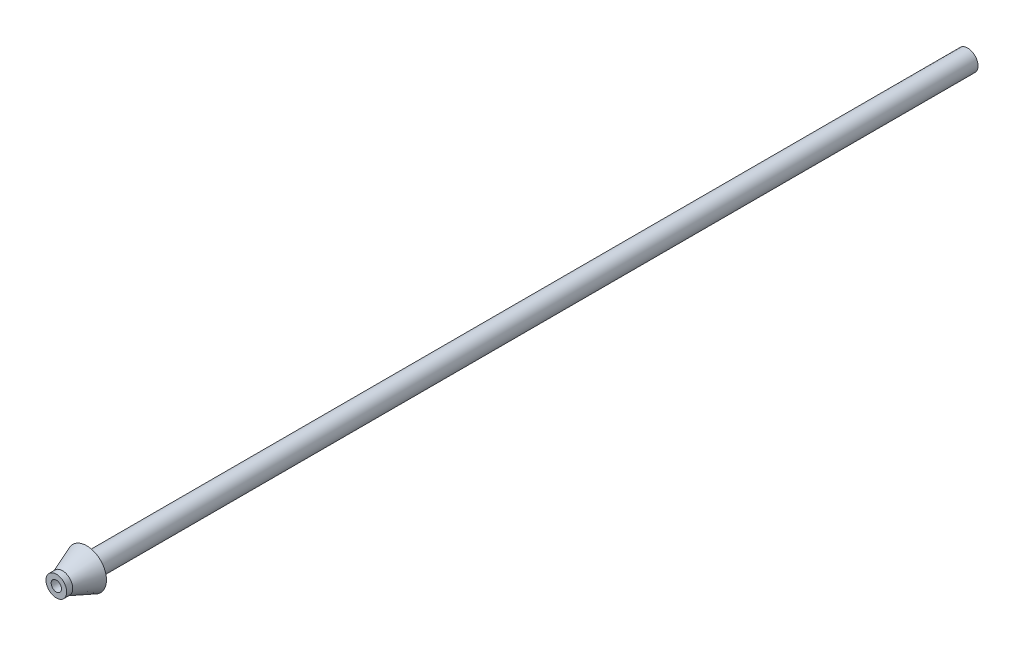
ISO-10303-21;
HEADER;
FILE_DESCRIPTION(('STEP AP214'),'2;1');
FILE_NAME('part.step','',(''),(''),'','','');
FILE_SCHEMA(('AUTOMOTIVE_DESIGN { 1 0 10303 214 1 1 1 1 }'));
ENDSEC;
DATA;
#1=APPLICATION_CONTEXT('core data for automotive mechanical design processes');
#2=APPLICATION_PROTOCOL_DEFINITION('international standard','automotive_design',2000,#1);
#3=PRODUCT_CONTEXT('',#1,'mechanical');
#4=PRODUCT('Part','Part','',(#3));
#5=PRODUCT_RELATED_PRODUCT_CATEGORY('part','',(#4));
#6=PRODUCT_DEFINITION_FORMATION('','',#4);
#7=PRODUCT_DEFINITION_CONTEXT('part definition',#1,'design');
#8=PRODUCT_DEFINITION('design','',#6,#7);
#9=PRODUCT_DEFINITION_SHAPE('','',#8);
#10=(LENGTH_UNIT() NAMED_UNIT(*) SI_UNIT(.MILLI.,.METRE.));
#11=(NAMED_UNIT(*) PLANE_ANGLE_UNIT() SI_UNIT($,.RADIAN.));
#12=(NAMED_UNIT(*) SI_UNIT($,.STERADIAN.) SOLID_ANGLE_UNIT());
#13=UNCERTAINTY_MEASURE_WITH_UNIT(LENGTH_MEASURE(1.E-05),#10,'distance_accuracy_value','');
#14=(GEOMETRIC_REPRESENTATION_CONTEXT(3) GLOBAL_UNCERTAINTY_ASSIGNED_CONTEXT((#13)) GLOBAL_UNIT_ASSIGNED_CONTEXT((#10,
#11,#12)) REPRESENTATION_CONTEXT('',''));
#15=CARTESIAN_POINT('',(0.,0.,0.));
#16=DIRECTION('',(0.,0.,1.));
#17=DIRECTION('',(1.,0.,0.));
#18=AXIS2_PLACEMENT_3D('',#15,#16,#17);
#19=CARTESIAN_POINT('',(0.,0.,150.));
#20=DIRECTION('',(0.,0.,-1.));
#21=DIRECTION('',(-1.,0.,0.));
#22=AXIS2_PLACEMENT_3D('',#19,#20,#21);
#23=CYLINDRICAL_SURFACE('',#22,1.7);
#24=CARTESIAN_POINT('',(0.,0.,150.));
#25=DIRECTION('',(0.,0.,1.));
#26=DIRECTION('',(1.,0.,0.));
#27=AXIS2_PLACEMENT_3D('',#24,#25,#26);
#28=CIRCLE('',#27,1.7);
#29=CARTESIAN_POINT('',(1.7,0.,150.));
#30=VERTEX_POINT('',#29);
#31=EDGE_CURVE('E45',#30,#30,#28,.T.);
#32=ORIENTED_EDGE('',*,*,#31,.F.);
#33=EDGE_LOOP('',(#32));
#34=FACE_BOUND('',#33,.T.);
#35=CARTESIAN_POINT('',(0.,0.,149.));
#36=DIRECTION('',(0.,0.,-1.));
#37=DIRECTION('',(-1.,0.,0.));
#38=AXIS2_PLACEMENT_3D('',#35,#36,#37);
#39=CIRCLE('',#38,1.7);
#40=CARTESIAN_POINT('',(-1.7,0.,149.));
#41=VERTEX_POINT('',#40);
#42=EDGE_CURVE('E10',#41,#41,#39,.T.);
#43=ORIENTED_EDGE('',*,*,#42,.F.);
#44=EDGE_LOOP('',(#43));
#45=FACE_BOUND('',#44,.T.);
#46=ADVANCED_FACE('F35',(#34,#45),#23,.T.);
#47=CARTESIAN_POINT('',(0.,0.,0.));
#48=DIRECTION('',(0.,0.,1.));
#49=DIRECTION('',(1.,0.,0.));
#50=AXIS2_PLACEMENT_3D('',#47,#48,#49);
#51=CIRCLE('',#50,1.7);
#52=CARTESIAN_POINT('',(1.7,0.,0.));
#53=VERTEX_POINT('',#52);
#54=EDGE_CURVE('E49',#53,#53,#51,.T.);
#55=ORIENTED_EDGE('',*,*,#54,.T.);
#56=EDGE_LOOP('',(#55));
#57=FACE_BOUND('',#56,.T.);
#58=CARTESIAN_POINT('',(0.,0.,145.));
#59=DIRECTION('',(0.,0.,1.));
#60=DIRECTION('',(1.,0.,0.));
#61=AXIS2_PLACEMENT_3D('',#58,#59,#60);
#62=CIRCLE('',#61,1.7);
#63=CARTESIAN_POINT('',(1.7,0.,145.));
#64=VERTEX_POINT('',#63);
#65=EDGE_CURVE('E41',#64,#64,#62,.T.);
#66=ORIENTED_EDGE('',*,*,#65,.F.);
#67=EDGE_LOOP('',(#66));
#68=FACE_BOUND('',#67,.T.);
#69=ADVANCED_FACE('F75',(#57,#68),#23,.T.);
#70=CARTESIAN_POINT('',(0.,0.,150.));
#71=DIRECTION('',(0.,0.,1.));
#72=DIRECTION('',(1.,0.,0.));
#73=AXIS2_PLACEMENT_3D('',#70,#71,#72);
#74=PLANE('',#73);
#75=ORIENTED_EDGE('',*,*,#31,.T.);
#76=EDGE_LOOP('',(#75));
#77=FACE_BOUND('',#76,.T.);
#78=CARTESIAN_POINT('',(0.,0.,150.));
#79=DIRECTION('',(0.,0.,1.));
#80=DIRECTION('',(1.,0.,0.));
#81=AXIS2_PLACEMENT_3D('',#78,#79,#80);
#82=CIRCLE('',#81,0.85);
#83=CARTESIAN_POINT('',(0.85,0.,150.));
#84=VERTEX_POINT('',#83);
#85=EDGE_CURVE('E53',#84,#84,#82,.T.);
#86=ORIENTED_EDGE('',*,*,#85,.F.);
#87=EDGE_LOOP('',(#86));
#88=FACE_BOUND('',#87,.T.);
#89=ADVANCED_FACE('F80',(#77,#88),#74,.T.);
#90=CARTESIAN_POINT('',(0.,0.,0.));
#91=DIRECTION('',(0.,0.,1.));
#92=DIRECTION('',(1.,0.,0.));
#93=AXIS2_PLACEMENT_3D('',#90,#91,#92);
#94=PLANE('',#93);
#95=ORIENTED_EDGE('',*,*,#54,.F.);
#96=EDGE_LOOP('',(#95));
#97=FACE_BOUND('',#96,.T.);
#98=CARTESIAN_POINT('',(0.,0.,0.));
#99=DIRECTION('',(0.,0.,1.));
#100=DIRECTION('',(1.,0.,0.));
#101=AXIS2_PLACEMENT_3D('',#98,#99,#100);
#102=CIRCLE('',#101,0.85);
#103=CARTESIAN_POINT('',(0.85,0.,0.));
#104=VERTEX_POINT('',#103);
#105=EDGE_CURVE('E55',#104,#104,#102,.T.);
#106=ORIENTED_EDGE('',*,*,#105,.T.);
#107=EDGE_LOOP('',(#106));
#108=FACE_BOUND('',#107,.T.);
#109=ADVANCED_FACE('F87',(#97,#108),#94,.F.);
#110=CARTESIAN_POINT('',(0.,0.,150.));
#111=DIRECTION('',(0.,0.,-1.));
#112=DIRECTION('',(-1.,0.,0.));
#113=AXIS2_PLACEMENT_3D('',#110,#111,#112);
#114=CYLINDRICAL_SURFACE('',#113,0.85);
#115=ORIENTED_EDGE('',*,*,#85,.T.);
#116=EDGE_LOOP('',(#115));
#117=FACE_BOUND('',#116,.T.);
#118=ORIENTED_EDGE('',*,*,#105,.F.);
#119=EDGE_LOOP('',(#118));
#120=FACE_BOUND('',#119,.T.);
#121=ADVANCED_FACE('F72',(#117,#120),#114,.F.);
#122=CARTESIAN_POINT('',(0.,0.,145.));
#123=DIRECTION('',(0.,0.,-1.));
#124=DIRECTION('',(-1.,0.,0.));
#125=AXIS2_PLACEMENT_3D('',#122,#123,#124);
#126=CONICAL_SURFACE('',#125,3.25,0.369684288795301);
#127=ORIENTED_EDGE('',*,*,#42,.T.);
#128=EDGE_LOOP('',(#127));
#129=FACE_BOUND('',#128,.T.);
#130=CARTESIAN_POINT('',(0.,0.,145.));
#131=DIRECTION('',(0.,0.,1.));
#132=DIRECTION('',(1.,0.,0.));
#133=AXIS2_PLACEMENT_3D('',#130,#131,#132);
#134=CIRCLE('',#133,3.25);
#135=CARTESIAN_POINT('',(3.25,0.,145.));
#136=VERTEX_POINT('',#135);
#137=EDGE_CURVE('E58',#136,#136,#134,.T.);
#138=ORIENTED_EDGE('',*,*,#137,.T.);
#139=EDGE_LOOP('',(#138));
#140=FACE_BOUND('',#139,.T.);
#141=ADVANCED_FACE('F64',(#129,#140),#126,.T.);
#142=CARTESIAN_POINT('',(0.,3.25,145.));
#143=DIRECTION('',(0.,0.,1.));
#144=DIRECTION('',(1.,0.,0.));
#145=AXIS2_PLACEMENT_3D('',#142,#143,#144);
#146=PLANE('',#145);
#147=ORIENTED_EDGE('',*,*,#137,.F.);
#148=EDGE_LOOP('',(#147));
#149=FACE_BOUND('',#148,.T.);
#150=ORIENTED_EDGE('',*,*,#65,.T.);
#151=EDGE_LOOP('',(#150));
#152=FACE_BOUND('',#151,.T.);
#153=ADVANCED_FACE('F66',(#149,#152),#146,.F.);
#154=CLOSED_SHELL('',(#46,#69,#89,#109,#121,#141,#153));
#155=MANIFOLD_SOLID_BREP('B2',#154);
#156=ADVANCED_BREP_SHAPE_REPRESENTATION('',(#18,#155),#14);
#157=SHAPE_DEFINITION_REPRESENTATION(#9,#156);
ENDSEC;
END-ISO-10303-21;
